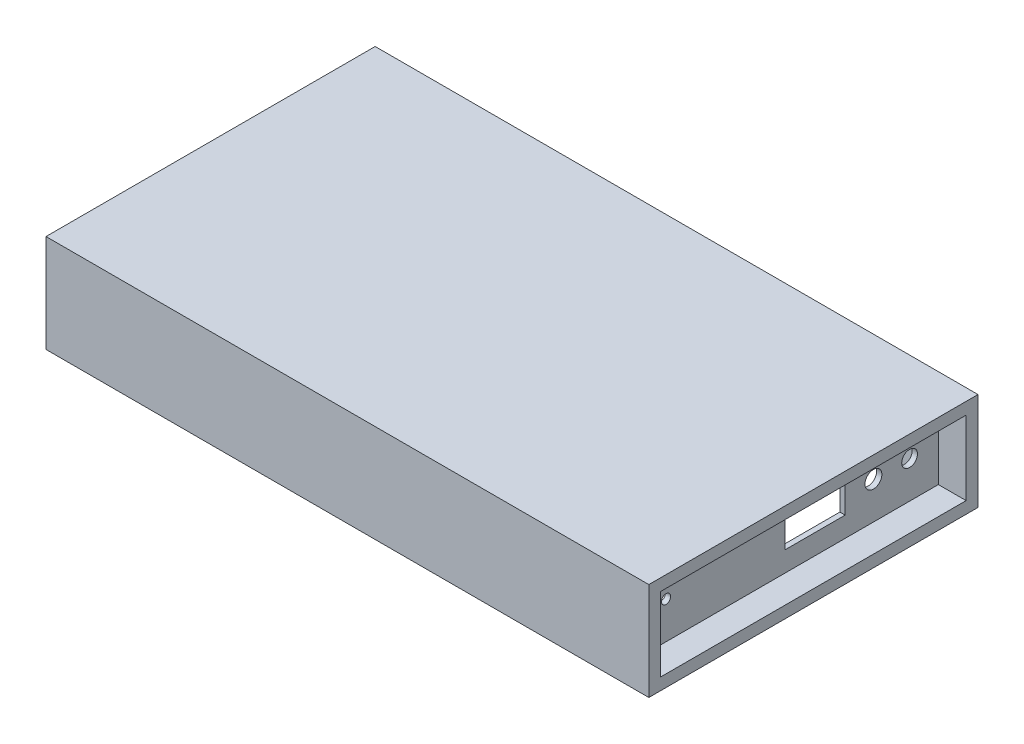
ISO-10303-21;
HEADER;
FILE_DESCRIPTION(('STEP AP214'),'2;1');
FILE_NAME('part.step','',(''),(''),'','','');
FILE_SCHEMA(('AUTOMOTIVE_DESIGN { 1 0 10303 214 1 1 1 1 }'));
ENDSEC;
DATA;
#1=APPLICATION_CONTEXT('core data for automotive mechanical design processes');
#2=APPLICATION_PROTOCOL_DEFINITION('international standard','automotive_design',2000,#1);
#3=PRODUCT_CONTEXT('',#1,'mechanical');
#4=PRODUCT('Part','Part','',(#3));
#5=PRODUCT_RELATED_PRODUCT_CATEGORY('part','',(#4));
#6=PRODUCT_DEFINITION_FORMATION('','',#4);
#7=PRODUCT_DEFINITION_CONTEXT('part definition',#1,'design');
#8=PRODUCT_DEFINITION('design','',#6,#7);
#9=PRODUCT_DEFINITION_SHAPE('','',#8);
#10=(LENGTH_UNIT() NAMED_UNIT(*) SI_UNIT(.MILLI.,.METRE.));
#11=(NAMED_UNIT(*) PLANE_ANGLE_UNIT() SI_UNIT($,.RADIAN.));
#12=(NAMED_UNIT(*) SI_UNIT($,.STERADIAN.) SOLID_ANGLE_UNIT());
#13=UNCERTAINTY_MEASURE_WITH_UNIT(LENGTH_MEASURE(1.E-05),#10,'distance_accuracy_value','');
#14=(GEOMETRIC_REPRESENTATION_CONTEXT(3) GLOBAL_UNCERTAINTY_ASSIGNED_CONTEXT((#13)) GLOBAL_UNIT_ASSIGNED_CONTEXT((#10,
#11,#12)) REPRESENTATION_CONTEXT('',''));
#15=CARTESIAN_POINT('',(0.,0.,0.));
#16=DIRECTION('',(0.,0.,1.));
#17=DIRECTION('',(1.,0.,0.));
#18=AXIS2_PLACEMENT_3D('',#15,#16,#17);
#19=CARTESIAN_POINT('',(-219.,-65.,115.5));
#20=DIRECTION('',(0.,0.,1.));
#21=DIRECTION('',(1.,0.,0.));
#22=AXIS2_PLACEMENT_3D('',#19,#20,#21);
#23=PLANE('',#22);
#24=DIRECTION('',(0.,1.,0.));
#25=VECTOR('',#24,1.);
#26=CARTESIAN_POINT('',(203.,-296.034629438965,115.5));
#27=LINE('',#26,#25);
#28=CARTESIAN_POINT('',(203.,-65.,115.5));
#29=VERTEX_POINT('',#28);
#30=CARTESIAN_POINT('',(203.,0.,115.5));
#31=VERTEX_POINT('',#30);
#32=EDGE_CURVE('E262',#29,#31,#27,.T.);
#33=ORIENTED_EDGE('',*,*,#32,.F.);
#34=DIRECTION('',(1.,0.,0.));
#35=VECTOR('',#34,1.);
#36=CARTESIAN_POINT('',(-219.,-65.,115.5));
#37=LINE('',#36,#35);
#38=CARTESIAN_POINT('',(-219.,-65.,115.5));
#39=VERTEX_POINT('',#38);
#40=EDGE_CURVE('E287',#39,#29,#37,.T.);
#41=ORIENTED_EDGE('',*,*,#40,.F.);
#42=DIRECTION('',(0.,1.,0.));
#43=VECTOR('',#42,1.);
#44=CARTESIAN_POINT('',(-219.,-65.,115.5));
#45=LINE('',#44,#43);
#46=CARTESIAN_POINT('',(-219.,0.,115.5));
#47=VERTEX_POINT('',#46);
#48=EDGE_CURVE('E304',#39,#47,#45,.T.);
#49=ORIENTED_EDGE('',*,*,#48,.T.);
#50=DIRECTION('',(1.,0.,0.));
#51=VECTOR('',#50,1.);
#52=CARTESIAN_POINT('',(-219.,0.,115.5));
#53=LINE('',#52,#51);
#54=EDGE_CURVE('E283',#47,#31,#53,.T.);
#55=ORIENTED_EDGE('',*,*,#54,.T.);
#56=EDGE_LOOP('',(#33,#41,#49,#55));
#57=FACE_BOUND('',#56,.T.);
#58=ADVANCED_FACE('F47',(#57),#23,.F.);
#59=DIRECTION('',(0.,1.,0.));
#60=VECTOR('',#59,1.);
#61=CARTESIAN_POINT('',(228.,0.,115.5));
#62=LINE('',#61,#60);
#63=CARTESIAN_POINT('',(228.,-56.,115.5));
#64=VERTEX_POINT('',#63);
#65=CARTESIAN_POINT('',(228.,0.,115.5));
#66=VERTEX_POINT('',#65);
#67=EDGE_CURVE('E271',#64,#66,#62,.T.);
#68=ORIENTED_EDGE('',*,*,#67,.F.);
#69=DIRECTION('',(1.,0.,0.));
#70=VECTOR('',#69,1.);
#71=CARTESIAN_POINT('',(-24.1752581917019,-56.,115.5));
#72=LINE('',#71,#70);
#73=CARTESIAN_POINT('',(207.,-56.,115.5));
#74=VERTEX_POINT('',#73);
#75=EDGE_CURVE('E237',#74,#64,#72,.T.);
#76=ORIENTED_EDGE('',*,*,#75,.F.);
#77=DIRECTION('',(0.,1.,0.));
#78=VECTOR('',#77,1.);
#79=CARTESIAN_POINT('',(207.,-296.034629438965,115.5));
#80=LINE('',#79,#78);
#81=CARTESIAN_POINT('',(207.,0.,115.5));
#82=VERTEX_POINT('',#81);
#83=EDGE_CURVE('E248',#74,#82,#80,.T.);
#84=ORIENTED_EDGE('',*,*,#83,.T.);
#85=EDGE_CURVE('E300',#82,#66,#53,.T.);
#86=ORIENTED_EDGE('',*,*,#85,.T.);
#87=EDGE_LOOP('',(#68,#76,#84,#86));
#88=FACE_BOUND('',#87,.T.);
#89=ADVANCED_FACE('F380',(#88),#23,.F.);
#90=CARTESIAN_POINT('',(-219.,-65.,-115.5));
#91=DIRECTION('',(0.,0.,-1.));
#92=DIRECTION('',(-1.,0.,0.));
#93=AXIS2_PLACEMENT_3D('',#90,#91,#92);
#94=PLANE('',#93);
#95=DIRECTION('',(0.,1.,0.));
#96=VECTOR('',#95,1.);
#97=CARTESIAN_POINT('',(203.,-296.034629438965,-115.5));
#98=LINE('',#97,#96);
#99=CARTESIAN_POINT('',(203.,-65.,-115.5));
#100=VERTEX_POINT('',#99);
#101=CARTESIAN_POINT('',(203.,0.,-115.5));
#102=VERTEX_POINT('',#101);
#103=EDGE_CURVE('E259',#100,#102,#98,.T.);
#104=ORIENTED_EDGE('',*,*,#103,.T.);
#105=DIRECTION('',(-1.,0.,0.));
#106=VECTOR('',#105,1.);
#107=CARTESIAN_POINT('',(-219.,0.,-115.5));
#108=LINE('',#107,#106);
#109=CARTESIAN_POINT('',(-219.,0.,-115.5));
#110=VERTEX_POINT('',#109);
#111=EDGE_CURVE('E278',#102,#110,#108,.T.);
#112=ORIENTED_EDGE('',*,*,#111,.T.);
#113=DIRECTION('',(0.,1.,0.));
#114=VECTOR('',#113,1.);
#115=CARTESIAN_POINT('',(-219.,-65.,-115.5));
#116=LINE('',#115,#114);
#117=CARTESIAN_POINT('',(-219.,-65.,-115.5));
#118=VERTEX_POINT('',#117);
#119=EDGE_CURVE('E291',#118,#110,#116,.T.);
#120=ORIENTED_EDGE('',*,*,#119,.F.);
#121=DIRECTION('',(-1.,0.,0.));
#122=VECTOR('',#121,1.);
#123=CARTESIAN_POINT('',(-219.,-65.,-115.5));
#124=LINE('',#123,#122);
#125=EDGE_CURVE('E279',#100,#118,#124,.T.);
#126=ORIENTED_EDGE('',*,*,#125,.F.);
#127=EDGE_LOOP('',(#104,#112,#120,#126));
#128=FACE_BOUND('',#127,.T.);
#129=ADVANCED_FACE('F386',(#128),#94,.F.);
#130=DIRECTION('',(0.,1.,0.));
#131=VECTOR('',#130,1.);
#132=CARTESIAN_POINT('',(207.,-296.034629438965,-115.5));
#133=LINE('',#132,#131);
#134=CARTESIAN_POINT('',(207.,-56.,-115.5));
#135=VERTEX_POINT('',#134);
#136=CARTESIAN_POINT('',(207.,0.,-115.5));
#137=VERTEX_POINT('',#136);
#138=EDGE_CURVE('E256',#135,#137,#133,.T.);
#139=ORIENTED_EDGE('',*,*,#138,.F.);
#140=DIRECTION('',(1.,0.,0.));
#141=VECTOR('',#140,1.);
#142=CARTESIAN_POINT('',(-24.1752581917019,-56.,-115.5));
#143=LINE('',#142,#141);
#144=CARTESIAN_POINT('',(228.,-56.,-115.5));
#145=VERTEX_POINT('',#144);
#146=EDGE_CURVE('E233',#135,#145,#143,.T.);
#147=ORIENTED_EDGE('',*,*,#146,.T.);
#148=DIRECTION('',(0.,-1.,0.));
#149=VECTOR('',#148,1.);
#150=CARTESIAN_POINT('',(228.,0.,-115.5));
#151=LINE('',#150,#149);
#152=CARTESIAN_POINT('',(228.,0.,-115.5));
#153=VERTEX_POINT('',#152);
#154=EDGE_CURVE('E247',#153,#145,#151,.T.);
#155=ORIENTED_EDGE('',*,*,#154,.F.);
#156=EDGE_CURVE('E292',#153,#137,#108,.T.);
#157=ORIENTED_EDGE('',*,*,#156,.T.);
#158=EDGE_LOOP('',(#139,#147,#155,#157));
#159=FACE_BOUND('',#158,.T.);
#160=ADVANCED_FACE('F396',(#159),#94,.F.);
#161=CARTESIAN_POINT('',(0.,0.,0.));
#162=DIRECTION('',(0.,1.,0.));
#163=DIRECTION('',(0.,0.,1.));
#164=AXIS2_PLACEMENT_3D('',#161,#162,#163);
#165=PLANE('',#164);
#166=DIRECTION('',(0.,0.,-1.));
#167=VECTOR('',#166,1.);
#168=CARTESIAN_POINT('',(203.,0.,115.5));
#169=LINE('',#168,#167);
#170=EDGE_CURVE('E252',#31,#102,#169,.T.);
#171=ORIENTED_EDGE('',*,*,#170,.F.);
#172=ORIENTED_EDGE('',*,*,#54,.F.);
#173=DIRECTION('',(0.,0.,1.));
#174=VECTOR('',#173,1.);
#175=CARTESIAN_POINT('',(-219.,0.,115.5));
#176=LINE('',#175,#174);
#177=EDGE_CURVE('E296',#110,#47,#176,.T.);
#178=ORIENTED_EDGE('',*,*,#177,.F.);
#179=ORIENTED_EDGE('',*,*,#111,.F.);
#180=EDGE_LOOP('',(#171,#172,#178,#179));
#181=FACE_BOUND('',#180,.T.);
#182=ADVANCED_FACE('F401',(#181),#165,.F.);
#183=DIRECTION('',(0.,0.,1.));
#184=VECTOR('',#183,1.);
#185=CARTESIAN_POINT('',(207.,0.,115.5));
#186=LINE('',#185,#184);
#187=EDGE_CURVE('E232',#137,#82,#186,.T.);
#188=ORIENTED_EDGE('',*,*,#187,.F.);
#189=ORIENTED_EDGE('',*,*,#156,.F.);
#190=DIRECTION('',(0.,0.,-1.));
#191=VECTOR('',#190,1.);
#192=CARTESIAN_POINT('',(228.,0.,0.));
#193=LINE('',#192,#191);
#194=EDGE_CURVE('E274',#66,#153,#193,.T.);
#195=ORIENTED_EDGE('',*,*,#194,.F.);
#196=ORIENTED_EDGE('',*,*,#85,.F.);
#197=EDGE_LOOP('',(#188,#189,#195,#196));
#198=FACE_BOUND('',#197,.T.);
#199=ADVANCED_FACE('F554',(#198),#165,.F.);
#200=CARTESIAN_POINT('',(-228.,9.,0.));
#201=DIRECTION('',(-1.,0.,0.));
#202=DIRECTION('',(0.,0.,1.));
#203=AXIS2_PLACEMENT_3D('',#200,#201,#202);
#204=PLANE('',#203);
#205=DIRECTION('',(0.,-1.,0.));
#206=VECTOR('',#205,1.);
#207=CARTESIAN_POINT('',(-228.,9.,-124.5));
#208=LINE('',#207,#206);
#209=CARTESIAN_POINT('',(-228.,9.,-124.5));
#210=VERTEX_POINT('',#209);
#211=CARTESIAN_POINT('',(-228.,-65.,-124.5));
#212=VERTEX_POINT('',#211);
#213=EDGE_CURVE('E340',#210,#212,#208,.T.);
#214=ORIENTED_EDGE('',*,*,#213,.T.);
#215=DIRECTION('',(0.,0.,1.));
#216=VECTOR('',#215,1.);
#217=CARTESIAN_POINT('',(-228.,-65.,124.5));
#218=LINE('',#217,#216);
#219=CARTESIAN_POINT('',(-228.,-65.,124.5));
#220=VERTEX_POINT('',#219);
#221=EDGE_CURVE('E322',#212,#220,#218,.T.);
#222=ORIENTED_EDGE('',*,*,#221,.T.);
#223=DIRECTION('',(0.,-1.,0.));
#224=VECTOR('',#223,1.);
#225=CARTESIAN_POINT('',(-228.,9.,124.5));
#226=LINE('',#225,#224);
#227=CARTESIAN_POINT('',(-228.,9.,124.5));
#228=VERTEX_POINT('',#227);
#229=EDGE_CURVE('E11',#228,#220,#226,.T.);
#230=ORIENTED_EDGE('',*,*,#229,.F.);
#231=DIRECTION('',(0.,0.,-1.));
#232=VECTOR('',#231,1.);
#233=CARTESIAN_POINT('',(-228.,9.,0.));
#234=LINE('',#233,#232);
#235=EDGE_CURVE('E326',#228,#210,#234,.T.);
#236=ORIENTED_EDGE('',*,*,#235,.T.);
#237=EDGE_LOOP('',(#214,#222,#230,#236));
#238=FACE_BOUND('',#237,.T.);
#239=ADVANCED_FACE('F49',(#238),#204,.T.);
#240=CARTESIAN_POINT('',(0.,9.,124.5));
#241=DIRECTION('',(0.,0.,-1.));
#242=DIRECTION('',(-1.,0.,0.));
#243=AXIS2_PLACEMENT_3D('',#240,#241,#242);
#244=PLANE('',#243);
#245=ORIENTED_EDGE('',*,*,#229,.T.);
#246=DIRECTION('',(1.,0.,0.));
#247=VECTOR('',#246,1.);
#248=CARTESIAN_POINT('',(-228.,-65.,124.5));
#249=LINE('',#248,#247);
#250=CARTESIAN_POINT('',(228.,-65.,124.5));
#251=VERTEX_POINT('',#250);
#252=EDGE_CURVE('E308',#220,#251,#249,.T.);
#253=ORIENTED_EDGE('',*,*,#252,.T.);
#254=DIRECTION('',(0.,-1.,0.));
#255=VECTOR('',#254,1.);
#256=CARTESIAN_POINT('',(228.,9.,124.5));
#257=LINE('',#256,#255);
#258=CARTESIAN_POINT('',(228.,9.,124.5));
#259=VERTEX_POINT('',#258);
#260=EDGE_CURVE('E56',#259,#251,#257,.T.);
#261=ORIENTED_EDGE('',*,*,#260,.F.);
#262=DIRECTION('',(1.,0.,0.));
#263=VECTOR('',#262,1.);
#264=CARTESIAN_POINT('',(0.,9.,124.5));
#265=LINE('',#264,#263);
#266=EDGE_CURVE('E330',#228,#259,#265,.T.);
#267=ORIENTED_EDGE('',*,*,#266,.F.);
#268=EDGE_LOOP('',(#245,#253,#261,#267));
#269=FACE_BOUND('',#268,.T.);
#270=ADVANCED_FACE('F361',(#269),#244,.F.);
#271=CARTESIAN_POINT('',(228.,9.,0.));
#272=DIRECTION('',(-1.,0.,0.));
#273=DIRECTION('',(0.,0.,1.));
#274=AXIS2_PLACEMENT_3D('',#271,#272,#273);
#275=PLANE('',#274);
#276=DIRECTION('',(0.,0.,1.));
#277=VECTOR('',#276,1.);
#278=CARTESIAN_POINT('',(228.,-56.,0.));
#279=LINE('',#278,#277);
#280=EDGE_CURVE('E228',#145,#64,#279,.T.);
#281=ORIENTED_EDGE('',*,*,#280,.T.);
#282=ORIENTED_EDGE('',*,*,#67,.T.);
#283=ORIENTED_EDGE('',*,*,#194,.T.);
#284=ORIENTED_EDGE('',*,*,#154,.T.);
#285=EDGE_LOOP('',(#281,#282,#283,#284));
#286=FACE_BOUND('',#285,.T.);
#287=DIRECTION('',(0.,0.,-1.));
#288=VECTOR('',#287,1.);
#289=CARTESIAN_POINT('',(228.,-65.,124.5));
#290=LINE('',#289,#288);
#291=CARTESIAN_POINT('',(228.,-65.,-124.5));
#292=VERTEX_POINT('',#291);
#293=EDGE_CURVE('E315',#251,#292,#290,.T.);
#294=ORIENTED_EDGE('',*,*,#293,.T.);
#295=DIRECTION('',(0.,-1.,0.));
#296=VECTOR('',#295,1.);
#297=CARTESIAN_POINT('',(228.,9.,-124.5));
#298=LINE('',#297,#296);
#299=CARTESIAN_POINT('',(228.,9.,-124.5));
#300=VERTEX_POINT('',#299);
#301=EDGE_CURVE('E343',#300,#292,#298,.T.);
#302=ORIENTED_EDGE('',*,*,#301,.F.);
#303=DIRECTION('',(0.,0.,-1.));
#304=VECTOR('',#303,1.);
#305=CARTESIAN_POINT('',(228.,9.,0.));
#306=LINE('',#305,#304);
#307=EDGE_CURVE('E333',#259,#300,#306,.T.);
#308=ORIENTED_EDGE('',*,*,#307,.F.);
#309=ORIENTED_EDGE('',*,*,#260,.T.);
#310=EDGE_LOOP('',(#294,#302,#308,#309));
#311=FACE_BOUND('',#310,.T.);
#312=ADVANCED_FACE('F351',(#286,#311),#275,.F.);
#313=CARTESIAN_POINT('',(0.,9.,-124.5));
#314=DIRECTION('',(0.,0.,-1.));
#315=DIRECTION('',(-1.,0.,0.));
#316=AXIS2_PLACEMENT_3D('',#313,#314,#315);
#317=PLANE('',#316);
#318=ORIENTED_EDGE('',*,*,#301,.T.);
#319=DIRECTION('',(-1.,0.,0.));
#320=VECTOR('',#319,1.);
#321=CARTESIAN_POINT('',(-228.,-65.,-124.5));
#322=LINE('',#321,#320);
#323=EDGE_CURVE('E318',#292,#212,#322,.T.);
#324=ORIENTED_EDGE('',*,*,#323,.T.);
#325=ORIENTED_EDGE('',*,*,#213,.F.);
#326=DIRECTION('',(1.,0.,0.));
#327=VECTOR('',#326,1.);
#328=CARTESIAN_POINT('',(0.,9.,-124.5));
#329=LINE('',#328,#327);
#330=EDGE_CURVE('E336',#210,#300,#329,.T.);
#331=ORIENTED_EDGE('',*,*,#330,.T.);
#332=EDGE_LOOP('',(#318,#324,#325,#331));
#333=FACE_BOUND('',#332,.T.);
#334=ADVANCED_FACE('F366',(#333),#317,.T.);
#335=CARTESIAN_POINT('',(0.,9.,0.));
#336=DIRECTION('',(0.,1.,0.));
#337=DIRECTION('',(0.,0.,1.));
#338=AXIS2_PLACEMENT_3D('',#335,#336,#337);
#339=PLANE('',#338);
#340=ORIENTED_EDGE('',*,*,#235,.F.);
#341=ORIENTED_EDGE('',*,*,#266,.T.);
#342=ORIENTED_EDGE('',*,*,#307,.T.);
#343=ORIENTED_EDGE('',*,*,#330,.F.);
#344=EDGE_LOOP('',(#340,#341,#342,#343));
#345=FACE_BOUND('',#344,.T.);
#346=ADVANCED_FACE('F368',(#345),#339,.T.);
#347=CARTESIAN_POINT('',(0.,-65.,0.));
#348=DIRECTION('',(0.,1.,0.));
#349=DIRECTION('',(0.,0.,1.));
#350=AXIS2_PLACEMENT_3D('',#347,#348,#349);
#351=PLANE('',#350);
#352=ORIENTED_EDGE('',*,*,#323,.F.);
#353=ORIENTED_EDGE('',*,*,#293,.F.);
#354=ORIENTED_EDGE('',*,*,#252,.F.);
#355=ORIENTED_EDGE('',*,*,#221,.F.);
#356=EDGE_LOOP('',(#352,#353,#354,#355));
#357=FACE_BOUND('',#356,.T.);
#358=ORIENTED_EDGE('',*,*,#40,.T.);
#359=DIRECTION('',(0.,0.,1.));
#360=VECTOR('',#359,1.);
#361=CARTESIAN_POINT('',(203.,-65.,115.5));
#362=LINE('',#361,#360);
#363=EDGE_CURVE('E243',#100,#29,#362,.T.);
#364=ORIENTED_EDGE('',*,*,#363,.F.);
#365=ORIENTED_EDGE('',*,*,#125,.T.);
#366=DIRECTION('',(0.,0.,1.));
#367=VECTOR('',#366,1.);
#368=CARTESIAN_POINT('',(-219.,-65.,115.5));
#369=LINE('',#368,#367);
#370=EDGE_CURVE('E282',#118,#39,#369,.T.);
#371=ORIENTED_EDGE('',*,*,#370,.T.);
#372=EDGE_LOOP('',(#358,#364,#365,#371));
#373=FACE_BOUND('',#372,.T.);
#374=ADVANCED_FACE('F358',(#357,#373),#351,.F.);
#375=CARTESIAN_POINT('',(-219.,-65.,115.5));
#376=DIRECTION('',(-1.,0.,0.));
#377=DIRECTION('',(0.,0.,1.));
#378=AXIS2_PLACEMENT_3D('',#375,#376,#377);
#379=PLANE('',#378);
#380=ORIENTED_EDGE('',*,*,#177,.T.);
#381=ORIENTED_EDGE('',*,*,#48,.F.);
#382=ORIENTED_EDGE('',*,*,#370,.F.);
#383=ORIENTED_EDGE('',*,*,#119,.T.);
#384=EDGE_LOOP('',(#380,#381,#382,#383));
#385=FACE_BOUND('',#384,.T.);
#386=ADVANCED_FACE('F375',(#385),#379,.F.);
#387=CARTESIAN_POINT('',(203.,-296.034629438965,115.5));
#388=DIRECTION('',(1.,0.,0.));
#389=DIRECTION('',(0.,0.,-1.));
#390=AXIS2_PLACEMENT_3D('',#387,#388,#389);
#391=PLANE('',#390);
#392=CARTESIAN_POINT('',(203.,-28.,90.5));
#393=DIRECTION('',(1.,0.,0.));
#394=DIRECTION('',(0.,0.,-1.));
#395=AXIS2_PLACEMENT_3D('',#392,#393,#394);
#396=CIRCLE('',#395,3.50000000000001);
#397=CARTESIAN_POINT('',(203.,-28.,87.));
#398=VERTEX_POINT('',#397);
#399=EDGE_CURVE('E223',#398,#398,#396,.T.);
#400=ORIENTED_EDGE('',*,*,#399,.T.);
#401=EDGE_LOOP('',(#400));
#402=FACE_BOUND('',#401,.T.);
#403=DIRECTION('',(0.,0.,-1.));
#404=VECTOR('',#403,1.);
#405=CARTESIAN_POINT('',(203.,-40.75,115.5));
#406=LINE('',#405,#404);
#407=CARTESIAN_POINT('',(203.,-40.75,0.49999999999998));
#408=VERTEX_POINT('',#407);
#409=CARTESIAN_POINT('',(203.,-40.75,-45.));
#410=VERTEX_POINT('',#409);
#411=EDGE_CURVE('E218',#408,#410,#406,.T.);
#412=ORIENTED_EDGE('',*,*,#411,.T.);
#413=DIRECTION('',(0.,1.,0.));
#414=VECTOR('',#413,1.);
#415=CARTESIAN_POINT('',(203.,-296.034629438965,-45.));
#416=LINE('',#415,#414);
#417=CARTESIAN_POINT('',(203.,-15.25,-45.));
#418=VERTEX_POINT('',#417);
#419=EDGE_CURVE('E163',#410,#418,#416,.T.);
#420=ORIENTED_EDGE('',*,*,#419,.T.);
#421=DIRECTION('',(0.,0.,1.));
#422=VECTOR('',#421,1.);
#423=CARTESIAN_POINT('',(203.,-15.25,115.5));
#424=LINE('',#423,#422);
#425=CARTESIAN_POINT('',(203.,-15.25,0.499999999999973));
#426=VERTEX_POINT('',#425);
#427=EDGE_CURVE('E210',#418,#426,#424,.T.);
#428=ORIENTED_EDGE('',*,*,#427,.T.);
#429=DIRECTION('',(0.,-1.,0.));
#430=VECTOR('',#429,1.);
#431=CARTESIAN_POINT('',(203.,-296.034629438965,0.499999999999987));
#432=LINE('',#431,#430);
#433=EDGE_CURVE('E214',#426,#408,#432,.T.);
#434=ORIENTED_EDGE('',*,*,#433,.T.);
#435=EDGE_LOOP('',(#412,#420,#428,#434));
#436=FACE_BOUND('',#435,.T.);
#437=CARTESIAN_POINT('',(203.,-28.,-66.4));
#438=DIRECTION('',(1.,0.,0.));
#439=DIRECTION('',(0.,0.,-1.));
#440=AXIS2_PLACEMENT_3D('',#437,#438,#439);
#441=CIRCLE('',#440,6.40000000000001);
#442=CARTESIAN_POINT('',(203.,-28.,-72.8));
#443=VERTEX_POINT('',#442);
#444=EDGE_CURVE('E206',#443,#443,#441,.T.);
#445=ORIENTED_EDGE('',*,*,#444,.T.);
#446=EDGE_LOOP('',(#445));
#447=FACE_BOUND('',#446,.T.);
#448=CARTESIAN_POINT('',(203.,-28.,-93.76));
#449=DIRECTION('',(1.,0.,0.));
#450=DIRECTION('',(0.,0.,-1.));
#451=AXIS2_PLACEMENT_3D('',#448,#449,#450);
#452=CIRCLE('',#451,5.96);
#453=CARTESIAN_POINT('',(203.,-28.,-99.72));
#454=VERTEX_POINT('',#453);
#455=EDGE_CURVE('E191',#454,#454,#452,.T.);
#456=ORIENTED_EDGE('',*,*,#455,.T.);
#457=EDGE_LOOP('',(#456));
#458=FACE_BOUND('',#457,.T.);
#459=ORIENTED_EDGE('',*,*,#103,.F.);
#460=ORIENTED_EDGE('',*,*,#363,.T.);
#461=ORIENTED_EDGE('',*,*,#32,.T.);
#462=ORIENTED_EDGE('',*,*,#170,.T.);
#463=EDGE_LOOP('',(#459,#460,#461,#462));
#464=FACE_BOUND('',#463,.T.);
#465=ADVANCED_FACE('F393',(#402,#436,#447,#458,#464),#391,.F.);
#466=CARTESIAN_POINT('',(207.,-296.034629438965,115.5));
#467=DIRECTION('',(-1.,0.,0.));
#468=DIRECTION('',(0.,0.,1.));
#469=AXIS2_PLACEMENT_3D('',#466,#467,#468);
#470=PLANE('',#469);
#471=CARTESIAN_POINT('',(207.,-28.,90.5));
#472=DIRECTION('',(1.,0.,0.));
#473=DIRECTION('',(0.,0.,-1.));
#474=AXIS2_PLACEMENT_3D('',#471,#472,#473);
#475=CIRCLE('',#474,3.50000000000001);
#476=CARTESIAN_POINT('',(207.,-28.,87.));
#477=VERTEX_POINT('',#476);
#478=EDGE_CURVE('E186',#477,#477,#475,.T.);
#479=ORIENTED_EDGE('',*,*,#478,.F.);
#480=EDGE_LOOP('',(#479));
#481=FACE_BOUND('',#480,.T.);
#482=DIRECTION('',(0.,0.,1.));
#483=VECTOR('',#482,1.);
#484=CARTESIAN_POINT('',(207.,-15.25,0.499999999999981));
#485=LINE('',#484,#483);
#486=CARTESIAN_POINT('',(207.,-15.25,-45.0000000000001));
#487=VERTEX_POINT('',#486);
#488=CARTESIAN_POINT('',(207.,-15.25,0.499999999999981));
#489=VERTEX_POINT('',#488);
#490=EDGE_CURVE('E184',#487,#489,#485,.T.);
#491=ORIENTED_EDGE('',*,*,#490,.F.);
#492=DIRECTION('',(0.,1.,0.));
#493=VECTOR('',#492,1.);
#494=CARTESIAN_POINT('',(207.,-40.75,-45.));
#495=LINE('',#494,#493);
#496=CARTESIAN_POINT('',(207.,-40.75,-45.));
#497=VERTEX_POINT('',#496);
#498=EDGE_CURVE('E71',#497,#487,#495,.T.);
#499=ORIENTED_EDGE('',*,*,#498,.F.);
#500=DIRECTION('',(0.,0.,-1.));
#501=VECTOR('',#500,1.);
#502=CARTESIAN_POINT('',(207.,-40.75,0.499999999999981));
#503=LINE('',#502,#501);
#504=CARTESIAN_POINT('',(207.,-40.75,0.499999999999981));
#505=VERTEX_POINT('',#504);
#506=EDGE_CURVE('E171',#505,#497,#503,.T.);
#507=ORIENTED_EDGE('',*,*,#506,.F.);
#508=DIRECTION('',(0.,-1.,0.));
#509=VECTOR('',#508,1.);
#510=CARTESIAN_POINT('',(207.,-40.75,0.499999999999981));
#511=LINE('',#510,#509);
#512=EDGE_CURVE('E178',#489,#505,#511,.T.);
#513=ORIENTED_EDGE('',*,*,#512,.F.);
#514=EDGE_LOOP('',(#491,#499,#507,#513));
#515=FACE_BOUND('',#514,.T.);
#516=CARTESIAN_POINT('',(207.,-28.,-66.4));
#517=DIRECTION('',(1.,0.,0.));
#518=DIRECTION('',(0.,0.,-1.));
#519=AXIS2_PLACEMENT_3D('',#516,#517,#518);
#520=CIRCLE('',#519,6.40000000000001);
#521=CARTESIAN_POINT('',(207.,-28.,-72.8));
#522=VERTEX_POINT('',#521);
#523=EDGE_CURVE('E168',#522,#522,#520,.T.);
#524=ORIENTED_EDGE('',*,*,#523,.F.);
#525=EDGE_LOOP('',(#524));
#526=FACE_BOUND('',#525,.T.);
#527=CARTESIAN_POINT('',(207.,-28.,-93.76));
#528=DIRECTION('',(1.,0.,0.));
#529=DIRECTION('',(0.,0.,-1.));
#530=AXIS2_PLACEMENT_3D('',#527,#528,#529);
#531=CIRCLE('',#530,5.96);
#532=CARTESIAN_POINT('',(207.,-28.,-99.72));
#533=VERTEX_POINT('',#532);
#534=EDGE_CURVE('E199',#533,#533,#531,.T.);
#535=ORIENTED_EDGE('',*,*,#534,.F.);
#536=EDGE_LOOP('',(#535));
#537=FACE_BOUND('',#536,.T.);
#538=ORIENTED_EDGE('',*,*,#83,.F.);
#539=DIRECTION('',(0.,0.,1.));
#540=VECTOR('',#539,1.);
#541=CARTESIAN_POINT('',(207.,-56.,0.));
#542=LINE('',#541,#540);
#543=EDGE_CURVE('E227',#135,#74,#542,.T.);
#544=ORIENTED_EDGE('',*,*,#543,.F.);
#545=ORIENTED_EDGE('',*,*,#138,.T.);
#546=ORIENTED_EDGE('',*,*,#187,.T.);
#547=EDGE_LOOP('',(#538,#544,#545,#546));
#548=FACE_BOUND('',#547,.T.);
#549=ADVANCED_FACE('F182',(#481,#515,#526,#537,#548),#470,.F.);
#550=CARTESIAN_POINT('',(-24.1752581917019,-56.,0.));
#551=DIRECTION('',(0.,1.,0.));
#552=DIRECTION('',(0.,0.,1.));
#553=AXIS2_PLACEMENT_3D('',#550,#551,#552);
#554=PLANE('',#553);
#555=ORIENTED_EDGE('',*,*,#146,.F.);
#556=ORIENTED_EDGE('',*,*,#543,.T.);
#557=ORIENTED_EDGE('',*,*,#75,.T.);
#558=ORIENTED_EDGE('',*,*,#280,.F.);
#559=EDGE_LOOP('',(#555,#556,#557,#558));
#560=FACE_BOUND('',#559,.T.);
#561=ADVANCED_FACE('F418',(#560),#554,.T.);
#562=CARTESIAN_POINT('',(57.,-28.,-93.76));
#563=DIRECTION('',(1.,0.,0.));
#564=DIRECTION('',(0.,0.,-1.));
#565=AXIS2_PLACEMENT_3D('',#562,#563,#564);
#566=CYLINDRICAL_SURFACE('',#565,5.96);
#567=ORIENTED_EDGE('',*,*,#534,.T.);
#568=EDGE_LOOP('',(#567));
#569=FACE_BOUND('',#568,.T.);
#570=ORIENTED_EDGE('',*,*,#455,.F.);
#571=EDGE_LOOP('',(#570));
#572=FACE_BOUND('',#571,.T.);
#573=ADVANCED_FACE('F424',(#569,#572),#566,.F.);
#574=CARTESIAN_POINT('',(57.,-28.,-66.4000000000001));
#575=DIRECTION('',(1.,0.,0.));
#576=DIRECTION('',(0.,0.,-1.));
#577=AXIS2_PLACEMENT_3D('',#574,#575,#576);
#578=CYLINDRICAL_SURFACE('',#577,6.40000000000001);
#579=ORIENTED_EDGE('',*,*,#523,.T.);
#580=EDGE_LOOP('',(#579));
#581=FACE_BOUND('',#580,.T.);
#582=ORIENTED_EDGE('',*,*,#444,.F.);
#583=EDGE_LOOP('',(#582));
#584=FACE_BOUND('',#583,.T.);
#585=ADVANCED_FACE('F428',(#581,#584),#578,.F.);
#586=CARTESIAN_POINT('',(57.,-40.75,-45.0000000000001));
#587=DIRECTION('',(0.,0.,-1.));
#588=DIRECTION('',(-1.,0.,0.));
#589=AXIS2_PLACEMENT_3D('',#586,#587,#588);
#590=PLANE('',#589);
#591=DIRECTION('',(1.,0.,0.));
#592=VECTOR('',#591,1.);
#593=CARTESIAN_POINT('',(57.,-40.75,-45.0000000000001));
#594=LINE('',#593,#592);
#595=EDGE_CURVE('E159',#410,#497,#594,.T.);
#596=ORIENTED_EDGE('',*,*,#595,.T.);
#597=ORIENTED_EDGE('',*,*,#498,.T.);
#598=DIRECTION('',(1.,0.,0.));
#599=VECTOR('',#598,1.);
#600=CARTESIAN_POINT('',(57.,-15.25,-45.0000000000001));
#601=LINE('',#600,#599);
#602=EDGE_CURVE('E179',#418,#487,#601,.T.);
#603=ORIENTED_EDGE('',*,*,#602,.F.);
#604=ORIENTED_EDGE('',*,*,#419,.F.);
#605=EDGE_LOOP('',(#596,#597,#603,#604));
#606=FACE_BOUND('',#605,.T.);
#607=ADVANCED_FACE('F161',(#606),#590,.F.);
#608=CARTESIAN_POINT('',(57.,-40.75,0.499999999999945));
#609=DIRECTION('',(0.,-1.,0.));
#610=DIRECTION('',(0.,0.,-1.));
#611=AXIS2_PLACEMENT_3D('',#608,#609,#610);
#612=PLANE('',#611);
#613=DIRECTION('',(1.,0.,0.));
#614=VECTOR('',#613,1.);
#615=CARTESIAN_POINT('',(57.,-40.75,0.499999999999945));
#616=LINE('',#615,#614);
#617=EDGE_CURVE('E167',#408,#505,#616,.T.);
#618=ORIENTED_EDGE('',*,*,#617,.T.);
#619=ORIENTED_EDGE('',*,*,#506,.T.);
#620=ORIENTED_EDGE('',*,*,#595,.F.);
#621=ORIENTED_EDGE('',*,*,#411,.F.);
#622=EDGE_LOOP('',(#618,#619,#620,#621));
#623=FACE_BOUND('',#622,.T.);
#624=ADVANCED_FACE('F172',(#623),#612,.F.);
#625=CARTESIAN_POINT('',(57.,-40.75,0.499999999999945));
#626=DIRECTION('',(0.,0.,1.));
#627=DIRECTION('',(1.,0.,0.));
#628=AXIS2_PLACEMENT_3D('',#625,#626,#627);
#629=PLANE('',#628);
#630=DIRECTION('',(1.,0.,0.));
#631=VECTOR('',#630,1.);
#632=CARTESIAN_POINT('',(57.,-15.25,0.499999999999945));
#633=LINE('',#632,#631);
#634=EDGE_CURVE('E63',#426,#489,#633,.T.);
#635=ORIENTED_EDGE('',*,*,#634,.T.);
#636=ORIENTED_EDGE('',*,*,#512,.T.);
#637=ORIENTED_EDGE('',*,*,#617,.F.);
#638=ORIENTED_EDGE('',*,*,#433,.F.);
#639=EDGE_LOOP('',(#635,#636,#637,#638));
#640=FACE_BOUND('',#639,.T.);
#641=ADVANCED_FACE('F435',(#640),#629,.F.);
#642=CARTESIAN_POINT('',(57.,-15.25,0.499999999999945));
#643=DIRECTION('',(0.,1.,0.));
#644=DIRECTION('',(0.,0.,1.));
#645=AXIS2_PLACEMENT_3D('',#642,#643,#644);
#646=PLANE('',#645);
#647=ORIENTED_EDGE('',*,*,#602,.T.);
#648=ORIENTED_EDGE('',*,*,#490,.T.);
#649=ORIENTED_EDGE('',*,*,#634,.F.);
#650=ORIENTED_EDGE('',*,*,#427,.F.);
#651=EDGE_LOOP('',(#647,#648,#649,#650));
#652=FACE_BOUND('',#651,.T.);
#653=ADVANCED_FACE('F438',(#652),#646,.F.);
#654=CARTESIAN_POINT('',(57.,-28.,90.5));
#655=DIRECTION('',(1.,0.,0.));
#656=DIRECTION('',(0.,0.,-1.));
#657=AXIS2_PLACEMENT_3D('',#654,#655,#656);
#658=CYLINDRICAL_SURFACE('',#657,3.50000000000001);
#659=ORIENTED_EDGE('',*,*,#478,.T.);
#660=EDGE_LOOP('',(#659));
#661=FACE_BOUND('',#660,.T.);
#662=ORIENTED_EDGE('',*,*,#399,.F.);
#663=EDGE_LOOP('',(#662));
#664=FACE_BOUND('',#663,.T.);
#665=ADVANCED_FACE('F442',(#661,#664),#658,.F.);
#666=CLOSED_SHELL('',(#58,#89,#129,#160,#182,#199,#239,#270,#312,#334,#346,#374,#386,#465,#549,
#561,#573,#585,#607,#624,#641,#653,#665));
#667=MANIFOLD_SOLID_BREP('B2',#666);
#668=ADVANCED_BREP_SHAPE_REPRESENTATION('',(#18,#667),#14);
#669=SHAPE_DEFINITION_REPRESENTATION(#9,#668);
ENDSEC;
END-ISO-10303-21;
